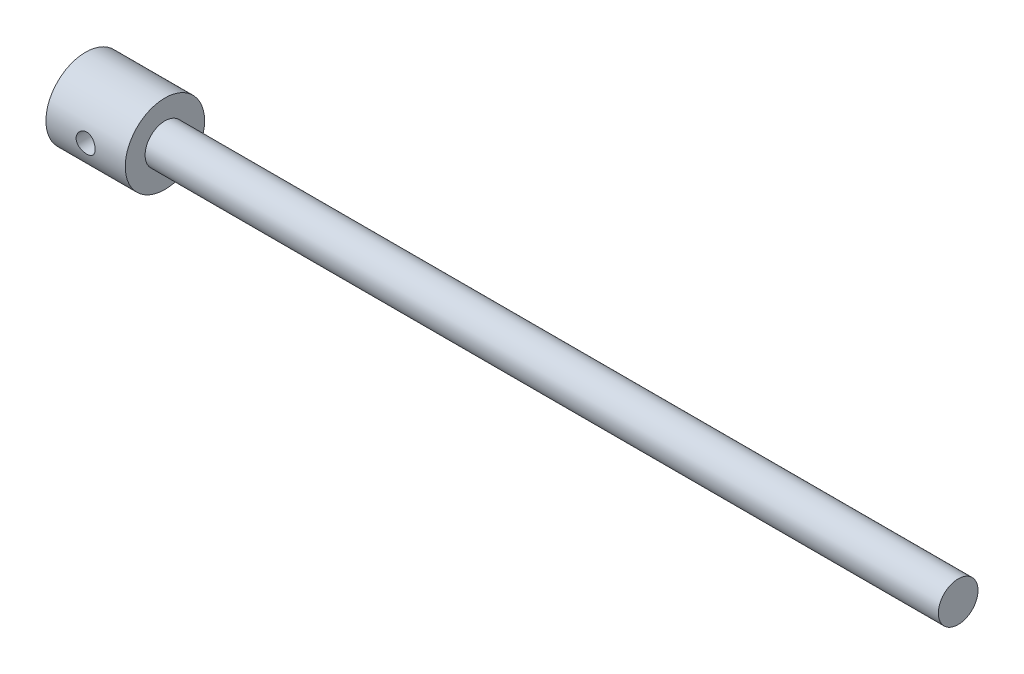
ISO-10303-21;
HEADER;
FILE_DESCRIPTION(('STEP AP214'),'2;1');
FILE_NAME('part.step','',(''),(''),'','','');
FILE_SCHEMA(('AUTOMOTIVE_DESIGN { 1 0 10303 214 1 1 1 1 }'));
ENDSEC;
DATA;
#1=APPLICATION_CONTEXT('core data for automotive mechanical design processes');
#2=APPLICATION_PROTOCOL_DEFINITION('international standard','automotive_design',2000,#1);
#3=PRODUCT_CONTEXT('',#1,'mechanical');
#4=PRODUCT('Part','Part','',(#3));
#5=PRODUCT_RELATED_PRODUCT_CATEGORY('part','',(#4));
#6=PRODUCT_DEFINITION_FORMATION('','',#4);
#7=PRODUCT_DEFINITION_CONTEXT('part definition',#1,'design');
#8=PRODUCT_DEFINITION('design','',#6,#7);
#9=PRODUCT_DEFINITION_SHAPE('','',#8);
#10=(LENGTH_UNIT() NAMED_UNIT(*) SI_UNIT(.MILLI.,.METRE.));
#11=(NAMED_UNIT(*) PLANE_ANGLE_UNIT() SI_UNIT($,.RADIAN.));
#12=(NAMED_UNIT(*) SI_UNIT($,.STERADIAN.) SOLID_ANGLE_UNIT());
#13=UNCERTAINTY_MEASURE_WITH_UNIT(LENGTH_MEASURE(1.E-05),#10,'distance_accuracy_value','');
#14=(GEOMETRIC_REPRESENTATION_CONTEXT(3) GLOBAL_UNCERTAINTY_ASSIGNED_CONTEXT((#13)) GLOBAL_UNIT_ASSIGNED_CONTEXT((#10,
#11,#12)) REPRESENTATION_CONTEXT('',''));
#15=CARTESIAN_POINT('',(0.,0.,0.));
#16=DIRECTION('',(0.,0.,1.));
#17=DIRECTION('',(1.,0.,0.));
#18=AXIS2_PLACEMENT_3D('',#15,#16,#17);
#19=CARTESIAN_POINT('',(50.,0.,0.));
#20=DIRECTION('',(1.,0.,0.));
#21=DIRECTION('',(0.,0.,-1.));
#22=AXIS2_PLACEMENT_3D('',#19,#20,#21);
#23=PLANE('',#22);
#24=CARTESIAN_POINT('',(50.,0.,0.));
#25=DIRECTION('',(1.,0.,0.));
#26=DIRECTION('',(0.,0.,-1.));
#27=AXIS2_PLACEMENT_3D('',#24,#25,#26);
#28=CIRCLE('',#27,25.);
#29=CARTESIAN_POINT('',(50.,0.,-25.));
#30=VERTEX_POINT('',#29);
#31=EDGE_CURVE('E45',#30,#30,#28,.T.);
#32=ORIENTED_EDGE('',*,*,#31,.T.);
#33=EDGE_LOOP('',(#32));
#34=FACE_BOUND('',#33,.T.);
#35=CARTESIAN_POINT('',(50.,0.,0.));
#36=DIRECTION('',(1.,0.,0.));
#37=DIRECTION('',(0.,0.,-1.));
#38=AXIS2_PLACEMENT_3D('',#35,#36,#37);
#39=CIRCLE('',#38,12.5);
#40=CARTESIAN_POINT('',(50.,0.,-12.5));
#41=VERTEX_POINT('',#40);
#42=EDGE_CURVE('E79',#41,#41,#39,.T.);
#43=ORIENTED_EDGE('',*,*,#42,.F.);
#44=EDGE_LOOP('',(#43));
#45=FACE_BOUND('',#44,.T.);
#46=ADVANCED_FACE('F33',(#34,#45),#23,.T.);
#47=CARTESIAN_POINT('',(50.,0.,0.));
#48=DIRECTION('',(-1.,0.,0.));
#49=DIRECTION('',(0.,0.,1.));
#50=AXIS2_PLACEMENT_3D('',#47,#48,#49);
#51=CYLINDRICAL_SURFACE('',#50,25.);
#52=CARTESIAN_POINT('',(19.,0.,25.));
#53=CARTESIAN_POINT('',(18.9999954345979,-0.166017736340745,25.0000026804997));
#54=CARTESIAN_POINT('',(19.0068916684901,-0.331984064130572,24.9983437383731));
#55=CARTESIAN_POINT('',(19.0344090099474,-0.662757375273786,24.9917601768854));
#56=CARTESIAN_POINT('',(19.0550318482831,-0.827564209779565,24.9868351457074));
#57=CARTESIAN_POINT('',(19.1098464151674,-1.15483168687375,24.9738504635424));
#58=CARTESIAN_POINT('',(19.144042956597,-1.31729147606248,24.9657897007271));
#59=CARTESIAN_POINT('',(19.2257380792299,-1.63872050759381,24.9467537443302));
#60=CARTESIAN_POINT('',(19.2732415602008,-1.79768844089951,24.9357774773038));
#61=CARTESIAN_POINT('',(19.3810845999628,-2.11072366381165,24.9112316091515));
#62=CARTESIAN_POINT('',(19.4414042632373,-2.26479812859839,24.897666030887));
#63=CARTESIAN_POINT('',(19.5744873495995,-2.56731972417304,24.8682925860487));
#64=CARTESIAN_POINT('',(19.6472553657249,-2.71576475309531,24.8524838922068));
#65=CARTESIAN_POINT('',(19.8046570905517,-3.00593509691774,24.8190587739081));
#66=CARTESIAN_POINT('',(19.8892862746391,-3.14766294672407,24.8014430394569));
#67=CARTESIAN_POINT('',(20.069871239809,-3.42359889441685,24.7648612187919));
#68=CARTESIAN_POINT('',(20.1658312721407,-3.55780414185137,24.7458946268123));
#69=CARTESIAN_POINT('',(20.3701054995632,-3.81996752921304,24.7067947855154));
#70=CARTESIAN_POINT('',(20.4785998623137,-3.94778319107672,24.6866473068088));
#71=CARTESIAN_POINT('',(20.7059123541216,-4.1939104375348,24.6460277155742));
#72=CARTESIAN_POINT('',(20.8247342977654,-4.31221847908384,24.6255554853983));
#73=CARTESIAN_POINT('',(21.0718508641517,-4.53846894982134,24.5848634527513));
#74=CARTESIAN_POINT('',(21.2001430008769,-4.64641408237687,24.5646435856504));
#75=CARTESIAN_POINT('',(21.4654368671125,-4.85128465634762,24.5250062264423));
#76=CARTESIAN_POINT('',(21.6024417935444,-4.94820601608992,24.5055890332168));
#77=CARTESIAN_POINT('',(21.8860890587549,-5.1315149308875,24.4678652790419));
#78=CARTESIAN_POINT('',(22.0328349214476,-5.21774615640803,24.4495768107614));
#79=CARTESIAN_POINT('',(22.3333541827147,-5.37754406139993,24.4149279468241));
#80=CARTESIAN_POINT('',(22.4871302069595,-5.45110595933349,24.3985682798489));
#81=CARTESIAN_POINT('',(22.8005322339703,-5.58492026214268,24.3682865029779));
#82=CARTESIAN_POINT('',(22.9601553549607,-5.64517912327471,24.354363211339));
#83=CARTESIAN_POINT('',(23.2841471254746,-5.75195806967359,24.3293636773731));
#84=CARTESIAN_POINT('',(23.4485174562414,-5.79847322039683,24.318288457803));
#85=CARTESIAN_POINT('',(23.9408008041614,-5.91523377010968,24.2902598679583));
#86=CARTESIAN_POINT('',(24.2741252508861,-5.96534620186163,24.2778811042379));
#87=CARTESIAN_POINT('',(24.7764756017562,-5.99819895021148,24.2697663322526));
#88=CARTESIAN_POINT('',(24.944385487369,-6.00209048242323,24.2688053008257));
#89=CARTESIAN_POINT('',(25.2799466612594,-5.99581246294927,24.2703574949624));
#90=CARTESIAN_POINT('',(25.4475979466414,-5.98564275494965,24.2728707591485));
#91=CARTESIAN_POINT('',(25.9407645620357,-5.93483975630032,24.285368999466));
#92=CARTESIAN_POINT('',(26.2643389073699,-5.87440247397774,24.3001939850224));
#93=CARTESIAN_POINT('',(26.8964448597611,-5.70184242669472,24.3412549446464));
#94=CARTESIAN_POINT('',(27.2049754689114,-5.58971623816142,24.3674916745551));
#95=CARTESIAN_POINT('',(27.8018123116943,-5.3158825349441,24.4286958367201));
#96=CARTESIAN_POINT('',(28.0899012463867,-5.15371899452584,24.4637429965247));
#97=CARTESIAN_POINT('',(28.6352126614859,-4.78473374953622,24.5385748778448));
#98=CARTESIAN_POINT('',(28.8924301230166,-4.57790479882186,24.5783603675971));
#99=CARTESIAN_POINT('',(29.3757861221912,-4.11902988641842,24.6594640880418));
#100=CARTESIAN_POINT('',(29.6009339253001,-3.86594129003371,24.7007951674045));
#101=CARTESIAN_POINT('',(30.0057697123241,-3.32511184695823,24.7793903091839));
#102=CARTESIAN_POINT('',(30.1854565134257,-3.03737009894219,24.8166542657671));
#103=CARTESIAN_POINT('',(30.4945943681691,-2.43405695507431,24.8830789940348));
#104=CARTESIAN_POINT('',(30.6238948942683,-2.11840557448716,24.9122154123614));
#105=CARTESIAN_POINT('',(30.8273301763013,-1.46899521159138,24.9589240940734));
#106=CARTESIAN_POINT('',(30.9014746350329,-1.13523942521409,24.9764983913503));
#107=CARTESIAN_POINT('',(30.9910041295196,-0.467574800827575,24.9978055089126));
#108=CARTESIAN_POINT('',(31.0077398031267,-0.133856966575297,25.0018564268946));
#109=CARTESIAN_POINT('',(30.9856664480962,0.531608768658087,24.9965614831509));
#110=CARTESIAN_POINT('',(30.946862003436,0.86335682994432,24.9872167270307));
#111=CARTESIAN_POINT('',(30.8159261145763,1.51084514007902,24.9563832816127));
#112=CARTESIAN_POINT('',(30.7245220476407,1.82674108394961,24.9350603275565));
#113=CARTESIAN_POINT('',(30.4918033497955,2.43870667494971,24.8826669936479));
#114=CARTESIAN_POINT('',(30.3504839183594,2.73477441187556,24.8515956762951));
#115=CARTESIAN_POINT('',(30.0192678250477,3.30412273668564,24.7823820658762));
#116=CARTESIAN_POINT('',(29.828602373031,3.57694246966835,24.7441307708391));
#117=CARTESIAN_POINT('',(29.4050823344903,4.08719914724014,24.6649871461435));
#118=CARTESIAN_POINT('',(29.1722210692648,4.32463047973872,24.6240943990595));
#119=CARTESIAN_POINT('',(28.6647328758583,4.76284500809666,24.5431489449983));
#120=CARTESIAN_POINT('',(28.3892845820887,4.96268414096836,24.5031358001301));
#121=CARTESIAN_POINT('',(27.8077643204089,5.31333575577367,24.4295058119813));
#122=CARTESIAN_POINT('',(27.5016937245063,5.46415043292342,24.395888682328));
#123=CARTESIAN_POINT('',(27.0274063160141,5.64963439053452,24.353347630646));
#124=CARTESIAN_POINT('',(26.8671930433855,5.70458710242879,24.3405033891164));
#125=CARTESIAN_POINT('',(26.5425179799679,5.80079732294279,24.317755202926));
#126=CARTESIAN_POINT('',(26.3780578128567,5.84205998439172,24.3078501521252));
#127=CARTESIAN_POINT('',(26.0460820967707,5.91053741786634,24.2912903166139));
#128=CARTESIAN_POINT('',(25.8785664488948,5.93775173433046,24.2846356373073));
#129=CARTESIAN_POINT('',(25.5417335331449,5.97789965204539,24.2747841701866));
#130=CARTESIAN_POINT('',(25.3724163461392,5.99083389159896,24.2715872278157));
#131=CARTESIAN_POINT('',(25.0377512694882,6.00215499594079,24.2687899616173));
#132=CARTESIAN_POINT('',(24.8724167155264,6.00091722515412,24.2690968340135));
#133=CARTESIAN_POINT('',(24.5424564780652,5.9848087278487,24.2730742483489));
#134=CARTESIAN_POINT('',(24.3778307791921,5.96993829850501,24.2767447169658));
#135=CARTESIAN_POINT('',(24.0504453984338,5.92668661056589,24.2873399112073));
#136=CARTESIAN_POINT('',(23.8876860135017,5.89830323162515,24.294265147542));
#137=CARTESIAN_POINT('',(23.5652697985185,5.82827196779405,24.3111608262961));
#138=CARTESIAN_POINT('',(23.4056118937499,5.78662876790753,24.3211301931022));
#139=CARTESIAN_POINT('',(23.0911924810288,5.69063662986335,24.3437686465433));
#140=CARTESIAN_POINT('',(22.9364113728174,5.63634876916799,24.3564247302984));
#141=CARTESIAN_POINT('',(22.6320466118608,5.51539707483437,24.3840980883562));
#142=CARTESIAN_POINT('',(22.4824611704006,5.44873755154826,24.3991145400161));
#143=CARTESIAN_POINT('',(22.1893378330844,5.30348427217981,24.4310987091682));
#144=CARTESIAN_POINT('',(22.0458026516644,5.22488523075194,24.4480672900111));
#145=CARTESIAN_POINT('',(21.7658088548311,5.05635243091258,24.4834782828489));
#146=CARTESIAN_POINT('',(21.6293479164855,4.96642242689347,24.5019202059306));
#147=CARTESIAN_POINT('',(21.3610496167077,4.77346921711415,24.5402505889388));
#148=CARTESIAN_POINT('',(21.2294076688702,4.67017903544834,24.5601634300573));
#149=CARTESIAN_POINT('',(20.97529158151,4.45304880482868,24.600458146359));
#150=CARTESIAN_POINT('',(20.8528143188771,4.33921237965749,24.6208398586377));
#151=CARTESIAN_POINT('',(20.6177068870181,4.10164015488732,24.661530300392));
#152=CARTESIAN_POINT('',(20.5050825736226,3.97789855094998,24.6818389796797));
#153=CARTESIAN_POINT('',(20.2905518952424,3.7214296777047,24.7218081005976));
#154=CARTESIAN_POINT('',(20.1886416330669,3.58870570477298,24.7414687761375));
#155=CARTESIAN_POINT('',(19.9945760775045,3.31280088827595,24.7799327781137));
#156=CARTESIAN_POINT('',(19.9026127516375,3.16948213881107,24.7987162302532));
#157=CARTESIAN_POINT('',(19.7311469277116,2.8754381763477,24.8345280560803));
#158=CARTESIAN_POINT('',(19.6516398440273,2.72471571591035,24.8515570748485));
#159=CARTESIAN_POINT('',(19.5056877128525,2.41692354679156,24.883375777664));
#160=CARTESIAN_POINT('',(19.4392365266561,2.25985686316147,24.8981665133663));
#161=CARTESIAN_POINT('',(19.3198957279609,1.94048744711081,24.9250921884147));
#162=CARTESIAN_POINT('',(19.2670039437237,1.77818555787967,24.9372275530119));
#163=CARTESIAN_POINT('',(19.1479748265459,1.35190448336007,24.9647957983314));
#164=CARTESIAN_POINT('',(19.0925758515092,1.08469226075993,24.9779181465939));
#165=CARTESIAN_POINT('',(19.0185933557941,0.544940331071899,24.9955177731159));
#166=CARTESIAN_POINT('',(19.000007490886,0.272400964328514,24.9999956018512));
#167=CARTESIAN_POINT('',(19.,0.,25.));
#168=B_SPLINE_CURVE_WITH_KNOTS('',3,(#52,#53,#54,#55,#56,#57,#58,#59,#60,#61,#62,#63,#64,#65,
#66,#67,#68,#69,#70,#71,#72,#73,#74,#75,#76,#77,#78,#79,#80,#81,#82,#83,#84,#85,#86,#87,#88,#89,
#90,#91,#92,#93,#94,#95,#96,#97,#98,#99,#100,#101,#102,#103,#104,#105,#106,#107,#108,#109,#110,
#111,#112,#113,#114,#115,#116,#117,#118,#119,#120,#121,#122,#123,#124,#125,#126,#127,#128,#129,
#130,#131,#132,#133,#134,#135,#136,#137,#138,#139,#140,#141,#142,#143,#144,#145,#146,#147,#148,
#149,#150,#151,#152,#153,#154,#155,#156,#157,#158,#159,#160,#161,#162,#163,#164,#165,#166,#167),
.UNSPECIFIED.,.T.,.F.,(4,2,2,2,2,2,2,2,2,2,2,2,2,2,2,2,2,2,2,2,2,2,2,2,2,2,2,2,2,2,2,2,2,2,2,2,
2,2,2,2,2,2,2,2,2,2,2,2,2,2,2,2,2,2,2,2,2,4),(0.,0.497813360100956,0.995689500769749,
1.49374233325073,1.99197879609469,2.48944738770731,2.98709992652941,3.4845631426913,
3.98221359994715,4.48820831908742,4.99439073274952,5.50044073797177,6.00667750796929,
6.5196119014362,7.03273945954076,7.5456174354008,8.05867933189508,9.06463756237655,
9.56800871792683,10.0713854693234,11.0548629550303,12.0384055899336,13.0311908061742,
14.0241372047509,15.0430966233895,16.0620825507942,17.0840897493149,18.1059171185591,
19.1035329919673,20.1010665323702,21.085126203147,22.069280539993,23.0698021185097,
24.0704821968969,25.0936623603892,26.1167967016263,26.6258643414059,27.1347401541084,
27.6436324676663,28.1525020334114,28.6479253897995,29.1433379468293,29.6388282657176,
30.1341437102249,30.6271145113295,31.1199138801487,31.6129320389054,32.105787268885,
32.6107272666004,33.1154944014541,33.6205595212516,34.1254402854413,34.6387770201077,
35.1519243293048,35.6648297831432,36.177653036205,36.9945144051894,37.8113237554193),.UNSPECIFIED.);
#169=CARTESIAN_POINT('',(19.,0.,25.));
#170=VERTEX_POINT('',#169);
#171=EDGE_CURVE('E10',#170,#170,#168,.T.);
#172=ORIENTED_EDGE('',*,*,#171,.F.);
#173=EDGE_LOOP('',(#172));
#174=FACE_BOUND('',#173,.T.);
#175=CARTESIAN_POINT('',(0.,0.,0.));
#176=DIRECTION('',(1.,0.,0.));
#177=DIRECTION('',(0.,0.,-1.));
#178=AXIS2_PLACEMENT_3D('',#175,#176,#177);
#179=CIRCLE('',#178,25.);
#180=CARTESIAN_POINT('',(0.,0.,-25.));
#181=VERTEX_POINT('',#180);
#182=EDGE_CURVE('E49',#181,#181,#179,.T.);
#183=ORIENTED_EDGE('',*,*,#182,.T.);
#184=EDGE_LOOP('',(#183));
#185=FACE_BOUND('',#184,.T.);
#186=ORIENTED_EDGE('',*,*,#31,.F.);
#187=EDGE_LOOP('',(#186));
#188=FACE_BOUND('',#187,.T.);
#189=CARTESIAN_POINT('',(19.,0.,-25.));
#190=CARTESIAN_POINT('',(18.9999954345979,0.166017736340745,-25.0000026804997));
#191=CARTESIAN_POINT('',(19.0068916684901,0.331984064130572,-24.9983437383731));
#192=CARTESIAN_POINT('',(19.0344090099474,0.662757375273786,-24.9917601768854));
#193=CARTESIAN_POINT('',(19.0550318482831,0.827564209779565,-24.9868351457074));
#194=CARTESIAN_POINT('',(19.1098464151674,1.15483168687375,-24.9738504635424));
#195=CARTESIAN_POINT('',(19.144042956597,1.31729147606248,-24.9657897007271));
#196=CARTESIAN_POINT('',(19.2257380792299,1.63872050759381,-24.9467537443302));
#197=CARTESIAN_POINT('',(19.2732415602008,1.79768844089951,-24.9357774773038));
#198=CARTESIAN_POINT('',(19.3810845999628,2.11072366381165,-24.9112316091515));
#199=CARTESIAN_POINT('',(19.4414042632373,2.26479812859839,-24.897666030887));
#200=CARTESIAN_POINT('',(19.5744873495995,2.56731972417304,-24.8682925860487));
#201=CARTESIAN_POINT('',(19.6472553657249,2.71576475309531,-24.8524838922068));
#202=CARTESIAN_POINT('',(19.8046570905517,3.00593509691774,-24.8190587739081));
#203=CARTESIAN_POINT('',(19.8892862746391,3.14766294672407,-24.8014430394569));
#204=CARTESIAN_POINT('',(20.069871239809,3.42359889441685,-24.7648612187919));
#205=CARTESIAN_POINT('',(20.1658312721407,3.55780414185137,-24.7458946268123));
#206=CARTESIAN_POINT('',(20.3701054995632,3.81996752921304,-24.7067947855154));
#207=CARTESIAN_POINT('',(20.4785998623137,3.94778319107672,-24.6866473068088));
#208=CARTESIAN_POINT('',(20.7059123541216,4.1939104375348,-24.6460277155742));
#209=CARTESIAN_POINT('',(20.8247342977654,4.31221847908384,-24.6255554853983));
#210=CARTESIAN_POINT('',(21.0718508641517,4.53846894982134,-24.5848634527513));
#211=CARTESIAN_POINT('',(21.2001430008769,4.64641408237687,-24.5646435856504));
#212=CARTESIAN_POINT('',(21.4654368671125,4.85128465634762,-24.5250062264423));
#213=CARTESIAN_POINT('',(21.6024417935444,4.94820601608992,-24.5055890332168));
#214=CARTESIAN_POINT('',(21.8860890587549,5.1315149308875,-24.4678652790419));
#215=CARTESIAN_POINT('',(22.0328349214476,5.21774615640803,-24.4495768107614));
#216=CARTESIAN_POINT('',(22.3333541827147,5.37754406139993,-24.4149279468241));
#217=CARTESIAN_POINT('',(22.4871302069595,5.45110595933349,-24.3985682798489));
#218=CARTESIAN_POINT('',(22.8005322339703,5.58492026214268,-24.3682865029779));
#219=CARTESIAN_POINT('',(22.9601553549607,5.64517912327471,-24.354363211339));
#220=CARTESIAN_POINT('',(23.2841471254746,5.75195806967359,-24.3293636773731));
#221=CARTESIAN_POINT('',(23.4485174562414,5.79847322039683,-24.318288457803));
#222=CARTESIAN_POINT('',(23.9408008041614,5.91523377010968,-24.2902598679583));
#223=CARTESIAN_POINT('',(24.2741252508861,5.96534620186163,-24.2778811042379));
#224=CARTESIAN_POINT('',(24.7764756017562,5.99819895021148,-24.2697663322526));
#225=CARTESIAN_POINT('',(24.944385487369,6.00209048242323,-24.2688053008257));
#226=CARTESIAN_POINT('',(25.2799466612594,5.99581246294927,-24.2703574949624));
#227=CARTESIAN_POINT('',(25.4475979466414,5.98564275494965,-24.2728707591485));
#228=CARTESIAN_POINT('',(25.9407645620357,5.93483975630032,-24.285368999466));
#229=CARTESIAN_POINT('',(26.2643389073699,5.87440247397774,-24.3001939850224));
#230=CARTESIAN_POINT('',(26.8964448597611,5.70184242669472,-24.3412549446464));
#231=CARTESIAN_POINT('',(27.2049754689114,5.58971623816142,-24.3674916745551));
#232=CARTESIAN_POINT('',(27.8018123116943,5.3158825349441,-24.4286958367201));
#233=CARTESIAN_POINT('',(28.0899012463867,5.15371899452584,-24.4637429965247));
#234=CARTESIAN_POINT('',(28.6352126614859,4.78473374953622,-24.5385748778448));
#235=CARTESIAN_POINT('',(28.8924301230166,4.57790479882186,-24.5783603675971));
#236=CARTESIAN_POINT('',(29.3757861221912,4.11902988641842,-24.6594640880418));
#237=CARTESIAN_POINT('',(29.6009339253001,3.86594129003371,-24.7007951674045));
#238=CARTESIAN_POINT('',(30.0057697123241,3.32511184695823,-24.7793903091839));
#239=CARTESIAN_POINT('',(30.1854565134257,3.03737009894219,-24.8166542657671));
#240=CARTESIAN_POINT('',(30.4945943681691,2.43405695507431,-24.8830789940348));
#241=CARTESIAN_POINT('',(30.6238948942683,2.11840557448716,-24.9122154123614));
#242=CARTESIAN_POINT('',(30.8273301763013,1.46899521159138,-24.9589240940734));
#243=CARTESIAN_POINT('',(30.9014746350329,1.13523942521409,-24.9764983913503));
#244=CARTESIAN_POINT('',(30.9910041295196,0.467574800827575,-24.9978055089126));
#245=CARTESIAN_POINT('',(31.0077398031267,0.133856966575297,-25.0018564268946));
#246=CARTESIAN_POINT('',(30.9856664480962,-0.531608768658087,-24.9965614831509));
#247=CARTESIAN_POINT('',(30.946862003436,-0.86335682994432,-24.9872167270307));
#248=CARTESIAN_POINT('',(30.8159261145763,-1.51084514007902,-24.9563832816127));
#249=CARTESIAN_POINT('',(30.7245220476407,-1.82674108394961,-24.9350603275565));
#250=CARTESIAN_POINT('',(30.4918033497955,-2.43870667494971,-24.8826669936479));
#251=CARTESIAN_POINT('',(30.3504839183594,-2.73477441187556,-24.8515956762951));
#252=CARTESIAN_POINT('',(30.0192678250477,-3.30412273668564,-24.7823820658762));
#253=CARTESIAN_POINT('',(29.828602373031,-3.57694246966835,-24.7441307708391));
#254=CARTESIAN_POINT('',(29.4050823344903,-4.08719914724014,-24.6649871461435));
#255=CARTESIAN_POINT('',(29.1722210692648,-4.32463047973872,-24.6240943990595));
#256=CARTESIAN_POINT('',(28.6647328758583,-4.76284500809666,-24.5431489449983));
#257=CARTESIAN_POINT('',(28.3892845820887,-4.96268414096836,-24.5031358001301));
#258=CARTESIAN_POINT('',(27.8077643204089,-5.31333575577367,-24.4295058119813));
#259=CARTESIAN_POINT('',(27.5016937245063,-5.46415043292342,-24.395888682328));
#260=CARTESIAN_POINT('',(27.0274063160141,-5.64963439053452,-24.353347630646));
#261=CARTESIAN_POINT('',(26.8671930433855,-5.70458710242879,-24.3405033891164));
#262=CARTESIAN_POINT('',(26.5425179799679,-5.80079732294279,-24.317755202926));
#263=CARTESIAN_POINT('',(26.3780578128567,-5.84205998439172,-24.3078501521252));
#264=CARTESIAN_POINT('',(26.0460820967707,-5.91053741786634,-24.2912903166139));
#265=CARTESIAN_POINT('',(25.8785664488948,-5.93775173433046,-24.2846356373073));
#266=CARTESIAN_POINT('',(25.5417335331449,-5.97789965204539,-24.2747841701866));
#267=CARTESIAN_POINT('',(25.3724163461392,-5.99083389159896,-24.2715872278157));
#268=CARTESIAN_POINT('',(25.0377512694882,-6.00215499594079,-24.2687899616173));
#269=CARTESIAN_POINT('',(24.8724167155264,-6.00091722515412,-24.2690968340135));
#270=CARTESIAN_POINT('',(24.5424564780652,-5.9848087278487,-24.2730742483489));
#271=CARTESIAN_POINT('',(24.3778307791921,-5.96993829850501,-24.2767447169658));
#272=CARTESIAN_POINT('',(24.0504453984338,-5.92668661056589,-24.2873399112073));
#273=CARTESIAN_POINT('',(23.8876860135017,-5.89830323162515,-24.294265147542));
#274=CARTESIAN_POINT('',(23.5652697985185,-5.82827196779405,-24.3111608262961));
#275=CARTESIAN_POINT('',(23.4056118937499,-5.78662876790753,-24.3211301931022));
#276=CARTESIAN_POINT('',(23.0911924810288,-5.69063662986335,-24.3437686465433));
#277=CARTESIAN_POINT('',(22.9364113728174,-5.63634876916799,-24.3564247302984));
#278=CARTESIAN_POINT('',(22.6320466118608,-5.51539707483437,-24.3840980883562));
#279=CARTESIAN_POINT('',(22.4824611704006,-5.44873755154826,-24.3991145400161));
#280=CARTESIAN_POINT('',(22.1893378330844,-5.30348427217981,-24.4310987091682));
#281=CARTESIAN_POINT('',(22.0458026516644,-5.22488523075194,-24.4480672900111));
#282=CARTESIAN_POINT('',(21.7658088548311,-5.05635243091258,-24.4834782828489));
#283=CARTESIAN_POINT('',(21.6293479164855,-4.96642242689347,-24.5019202059306));
#284=CARTESIAN_POINT('',(21.3610496167077,-4.77346921711415,-24.5402505889388));
#285=CARTESIAN_POINT('',(21.2294076688702,-4.67017903544834,-24.5601634300573));
#286=CARTESIAN_POINT('',(20.97529158151,-4.45304880482868,-24.600458146359));
#287=CARTESIAN_POINT('',(20.8528143188771,-4.33921237965749,-24.6208398586377));
#288=CARTESIAN_POINT('',(20.6177068870181,-4.10164015488732,-24.661530300392));
#289=CARTESIAN_POINT('',(20.5050825736226,-3.97789855094998,-24.6818389796797));
#290=CARTESIAN_POINT('',(20.2905518952424,-3.7214296777047,-24.7218081005976));
#291=CARTESIAN_POINT('',(20.1886416330669,-3.58870570477298,-24.7414687761375));
#292=CARTESIAN_POINT('',(19.9945760775045,-3.31280088827595,-24.7799327781137));
#293=CARTESIAN_POINT('',(19.9026127516375,-3.16948213881107,-24.7987162302532));
#294=CARTESIAN_POINT('',(19.7311469277116,-2.8754381763477,-24.8345280560803));
#295=CARTESIAN_POINT('',(19.6516398440273,-2.72471571591035,-24.8515570748485));
#296=CARTESIAN_POINT('',(19.5056877128525,-2.41692354679156,-24.883375777664));
#297=CARTESIAN_POINT('',(19.4392365266561,-2.25985686316147,-24.8981665133663));
#298=CARTESIAN_POINT('',(19.3198957279609,-1.94048744711081,-24.9250921884147));
#299=CARTESIAN_POINT('',(19.2670039437237,-1.77818555787967,-24.9372275530119));
#300=CARTESIAN_POINT('',(19.1479748265459,-1.35190448336007,-24.9647957983314));
#301=CARTESIAN_POINT('',(19.0925758515092,-1.08469226075993,-24.9779181465939));
#302=CARTESIAN_POINT('',(19.0185933557941,-0.544940331071899,-24.9955177731159));
#303=CARTESIAN_POINT('',(19.000007490886,-0.272400964328514,-24.9999956018512));
#304=CARTESIAN_POINT('',(19.,0.,-25.));
#305=B_SPLINE_CURVE_WITH_KNOTS('',3,(#189,#190,#191,#192,#193,#194,#195,#196,#197,#198,#199,
#200,#201,#202,#203,#204,#205,#206,#207,#208,#209,#210,#211,#212,#213,#214,#215,#216,#217,#218,
#219,#220,#221,#222,#223,#224,#225,#226,#227,#228,#229,#230,#231,#232,#233,#234,#235,#236,#237,
#238,#239,#240,#241,#242,#243,#244,#245,#246,#247,#248,#249,#250,#251,#252,#253,#254,#255,#256,
#257,#258,#259,#260,#261,#262,#263,#264,#265,#266,#267,#268,#269,#270,#271,#272,#273,#274,#275,
#276,#277,#278,#279,#280,#281,#282,#283,#284,#285,#286,#287,#288,#289,#290,#291,#292,#293,#294,
#295,#296,#297,#298,#299,#300,#301,#302,#303,#304),.UNSPECIFIED.,.T.,.F.,(4,2,2,2,2,2,2,2,2,2,2,
2,2,2,2,2,2,2,2,2,2,2,2,2,2,2,2,2,2,2,2,2,2,2,2,2,2,2,2,2,2,2,2,2,2,2,2,2,2,2,2,2,2,2,2,2,2,4),
(0.,0.497813360100956,0.995689500769749,1.49374233325073,1.99197879609469,2.48944738770731,
2.98709992652941,3.4845631426913,3.98221359994715,4.48820831908742,4.99439073274952,
5.50044073797177,6.00667750796929,6.5196119014362,7.03273945954076,7.5456174354008,
8.05867933189508,9.06463756237655,9.56800871792683,10.0713854693234,11.0548629550303,
12.0384055899336,13.0311908061742,14.0241372047509,15.0430966233895,16.0620825507942,
17.0840897493149,18.1059171185591,19.1035329919673,20.1010665323702,21.085126203147,
22.069280539993,23.0698021185097,24.0704821968969,25.0936623603892,26.1167967016263,
26.6258643414059,27.1347401541084,27.6436324676663,28.1525020334114,28.6479253897995,
29.1433379468293,29.6388282657176,30.1341437102249,30.6271145113295,31.1199138801487,
31.6129320389054,32.105787268885,32.6107272666004,33.1154944014541,33.6205595212516,
34.1254402854413,34.6387770201077,35.1519243293048,35.6648297831432,36.177653036205,
36.9945144051894,37.8113237554193),.UNSPECIFIED.);
#306=CARTESIAN_POINT('',(19.,0.,-25.));
#307=VERTEX_POINT('',#306);
#308=EDGE_CURVE('E38',#307,#307,#305,.T.);
#309=ORIENTED_EDGE('',*,*,#308,.F.);
#310=EDGE_LOOP('',(#309));
#311=FACE_BOUND('',#310,.T.);
#312=ADVANCED_FACE('F35',(#174,#185,#188,#311),#51,.T.);
#313=CARTESIAN_POINT('',(0.,0.,0.));
#314=DIRECTION('',(1.,0.,0.));
#315=DIRECTION('',(0.,0.,-1.));
#316=AXIS2_PLACEMENT_3D('',#313,#314,#315);
#317=PLANE('',#316);
#318=ORIENTED_EDGE('',*,*,#182,.F.);
#319=EDGE_LOOP('',(#318));
#320=FACE_BOUND('',#319,.T.);
#321=ADVANCED_FACE('F60',(#320),#317,.F.);
#322=CARTESIAN_POINT('',(25.,0.,25.));
#323=DIRECTION('',(0.,0.,-1.));
#324=DIRECTION('',(-1.,0.,0.));
#325=AXIS2_PLACEMENT_3D('',#322,#323,#324);
#326=CYLINDRICAL_SURFACE('',#325,6.);
#327=ORIENTED_EDGE('',*,*,#308,.T.);
#328=EDGE_LOOP('',(#327));
#329=FACE_BOUND('',#328,.T.);
#330=ORIENTED_EDGE('',*,*,#171,.T.);
#331=EDGE_LOOP('',(#330));
#332=FACE_BOUND('',#331,.T.);
#333=ADVANCED_FACE('F54',(#329,#332),#326,.F.);
#334=CARTESIAN_POINT('',(550.,0.,0.));
#335=DIRECTION('',(-1.,0.,0.));
#336=DIRECTION('',(0.,0.,1.));
#337=AXIS2_PLACEMENT_3D('',#334,#335,#336);
#338=CYLINDRICAL_SURFACE('',#337,12.5);
#339=CARTESIAN_POINT('',(550.,0.,0.));
#340=DIRECTION('',(1.,0.,0.));
#341=DIRECTION('',(0.,0.,-1.));
#342=AXIS2_PLACEMENT_3D('',#339,#340,#341);
#343=CIRCLE('',#342,12.5);
#344=CARTESIAN_POINT('',(550.,0.,-12.5));
#345=VERTEX_POINT('',#344);
#346=EDGE_CURVE('E76',#345,#345,#343,.T.);
#347=ORIENTED_EDGE('',*,*,#346,.F.);
#348=EDGE_LOOP('',(#347));
#349=FACE_BOUND('',#348,.T.);
#350=ORIENTED_EDGE('',*,*,#42,.T.);
#351=EDGE_LOOP('',(#350));
#352=FACE_BOUND('',#351,.T.);
#353=ADVANCED_FACE('F59',(#349,#352),#338,.T.);
#354=CARTESIAN_POINT('',(550.,0.,0.));
#355=DIRECTION('',(1.,0.,0.));
#356=DIRECTION('',(0.,0.,-1.));
#357=AXIS2_PLACEMENT_3D('',#354,#355,#356);
#358=PLANE('',#357);
#359=ORIENTED_EDGE('',*,*,#346,.T.);
#360=EDGE_LOOP('',(#359));
#361=FACE_BOUND('',#360,.T.);
#362=ADVANCED_FACE('F89',(#361),#358,.T.);
#363=CLOSED_SHELL('',(#46,#312,#321,#333,#353,#362));
#364=MANIFOLD_SOLID_BREP('B2',#363);
#365=ADVANCED_BREP_SHAPE_REPRESENTATION('',(#18,#364),#14);
#366=SHAPE_DEFINITION_REPRESENTATION(#9,#365);
ENDSEC;
END-ISO-10303-21;
